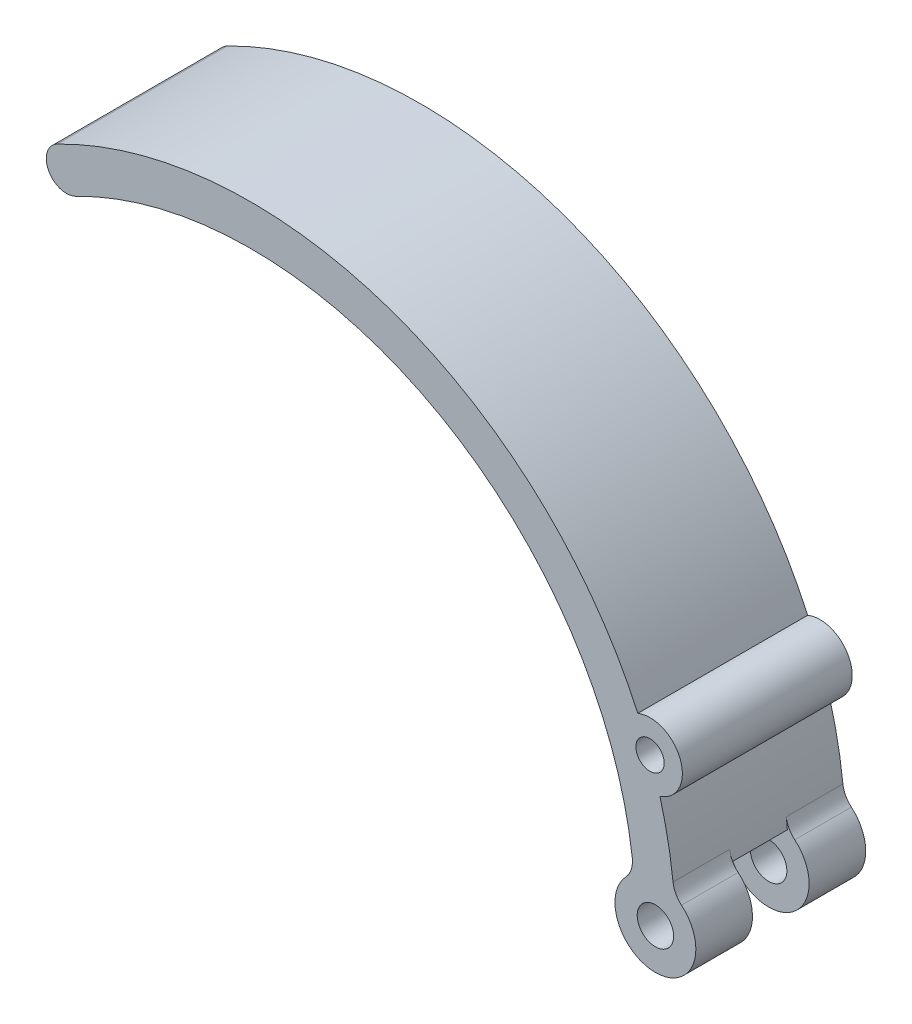
ISO-10303-21;
HEADER;
FILE_DESCRIPTION(('STEP AP214'),'2;1');
FILE_NAME('part.step','',(''),(''),'','','');
FILE_SCHEMA(('AUTOMOTIVE_DESIGN { 1 0 10303 214 1 1 1 1 }'));
ENDSEC;
DATA;
#1=APPLICATION_CONTEXT('core data for automotive mechanical design processes');
#2=APPLICATION_PROTOCOL_DEFINITION('international standard','automotive_design',2000,#1);
#3=PRODUCT_CONTEXT('',#1,'mechanical');
#4=PRODUCT('Part','Part','',(#3));
#5=PRODUCT_RELATED_PRODUCT_CATEGORY('part','',(#4));
#6=PRODUCT_DEFINITION_FORMATION('','',#4);
#7=PRODUCT_DEFINITION_CONTEXT('part definition',#1,'design');
#8=PRODUCT_DEFINITION('design','',#6,#7);
#9=PRODUCT_DEFINITION_SHAPE('','',#8);
#10=(LENGTH_UNIT() NAMED_UNIT(*) SI_UNIT(.MILLI.,.METRE.));
#11=(NAMED_UNIT(*) PLANE_ANGLE_UNIT() SI_UNIT($,.RADIAN.));
#12=(NAMED_UNIT(*) SI_UNIT($,.STERADIAN.) SOLID_ANGLE_UNIT());
#13=UNCERTAINTY_MEASURE_WITH_UNIT(LENGTH_MEASURE(1.E-05),#10,'distance_accuracy_value','');
#14=(GEOMETRIC_REPRESENTATION_CONTEXT(3) GLOBAL_UNCERTAINTY_ASSIGNED_CONTEXT((#13)) GLOBAL_UNIT_ASSIGNED_CONTEXT((#10,
#11,#12)) REPRESENTATION_CONTEXT('',''));
#15=CARTESIAN_POINT('',(0.,0.,0.));
#16=DIRECTION('',(0.,0.,1.));
#17=DIRECTION('',(1.,0.,0.));
#18=AXIS2_PLACEMENT_3D('',#15,#16,#17);
#19=CARTESIAN_POINT('',(0.,0.,21.));
#20=DIRECTION('',(0.,0.,-1.));
#21=DIRECTION('',(-1.,0.,0.));
#22=AXIS2_PLACEMENT_3D('',#19,#20,#21);
#23=CYLINDRICAL_SURFACE('',#22,52.5);
#24=CARTESIAN_POINT('',(0.,0.,0.));
#25=DIRECTION('',(0.,0.,1.));
#26=DIRECTION('',(1.,0.,0.));
#27=AXIS2_PLACEMENT_3D('',#24,#25,#26);
#28=CIRCLE('',#27,52.5);
#29=CARTESIAN_POINT('',(52.1807432432433,5.781006364183,0.));
#30=VERTEX_POINT('',#29);
#31=CARTESIAN_POINT('',(50.5577588361061,14.1478981290557,0.));
#32=VERTEX_POINT('',#31);
#33=EDGE_CURVE('E149',#30,#32,#28,.T.);
#34=ORIENTED_EDGE('',*,*,#33,.T.);
#35=DIRECTION('',(0.,0.,1.));
#36=VECTOR('',#35,1.);
#37=CARTESIAN_POINT('',(50.5577588361061,14.1478981290556,0.));
#38=LINE('',#37,#36);
#39=CARTESIAN_POINT('',(50.5577588361061,14.1478981290557,21.));
#40=VERTEX_POINT('',#39);
#41=EDGE_CURVE('E56',#32,#40,#38,.T.);
#42=ORIENTED_EDGE('',*,*,#41,.T.);
#43=CARTESIAN_POINT('',(0.,0.,21.));
#44=DIRECTION('',(0.,0.,1.));
#45=DIRECTION('',(1.,0.,0.));
#46=AXIS2_PLACEMENT_3D('',#43,#44,#45);
#47=CIRCLE('',#46,52.5);
#48=CARTESIAN_POINT('',(52.1807432432433,5.781006364183,21.));
#49=VERTEX_POINT('',#48);
#50=EDGE_CURVE('E194',#49,#40,#47,.T.);
#51=ORIENTED_EDGE('',*,*,#50,.F.);
#52=DIRECTION('',(0.,0.,-1.));
#53=VECTOR('',#52,1.);
#54=CARTESIAN_POINT('',(52.1807432432432,5.781006364183,21.));
#55=LINE('',#54,#53);
#56=CARTESIAN_POINT('',(52.1807432432433,5.781006364183,14.));
#57=VERTEX_POINT('',#56);
#58=EDGE_CURVE('E208',#49,#57,#55,.T.);
#59=ORIENTED_EDGE('',*,*,#58,.T.);
#60=CARTESIAN_POINT('',(0.,0.,14.));
#61=DIRECTION('',(0.,0.,1.));
#62=DIRECTION('',(1.,0.,0.));
#63=AXIS2_PLACEMENT_3D('',#60,#61,#62);
#64=CIRCLE('',#63,52.5);
#65=CARTESIAN_POINT('',(52.3125,4.43309640657633,14.));
#66=VERTEX_POINT('',#65);
#67=EDGE_CURVE('E198',#57,#66,#64,.F.);
#68=ORIENTED_EDGE('',*,*,#67,.T.);
#69=DIRECTION('',(0.,0.,1.));
#70=VECTOR('',#69,1.);
#71=CARTESIAN_POINT('',(52.3125,4.43309640657633,10.5));
#72=LINE('',#71,#70);
#73=CARTESIAN_POINT('',(52.3125,4.43309640657633,7.));
#74=VERTEX_POINT('',#73);
#75=EDGE_CURVE('E150',#66,#74,#72,.F.);
#76=ORIENTED_EDGE('',*,*,#75,.T.);
#77=CARTESIAN_POINT('',(0.,0.,7.));
#78=DIRECTION('',(0.,0.,1.));
#79=DIRECTION('',(1.,0.,0.));
#80=AXIS2_PLACEMENT_3D('',#77,#78,#79);
#81=CIRCLE('',#80,52.5);
#82=CARTESIAN_POINT('',(52.1807432432433,5.781006364183,7.));
#83=VERTEX_POINT('',#82);
#84=EDGE_CURVE('E211',#74,#83,#81,.T.);
#85=ORIENTED_EDGE('',*,*,#84,.T.);
#86=DIRECTION('',(0.,0.,-1.));
#87=VECTOR('',#86,1.);
#88=CARTESIAN_POINT('',(52.1807432432432,5.781006364183,21.));
#89=LINE('',#88,#87);
#90=EDGE_CURVE('E214',#83,#30,#89,.T.);
#91=ORIENTED_EDGE('',*,*,#90,.T.);
#92=EDGE_LOOP('',(#34,#42,#51,#59,#68,#76,#85,#91));
#93=FACE_BOUND('',#92,.T.);
#94=ADVANCED_FACE('F32',(#93),#23,.T.);
#95=CARTESIAN_POINT('',(50.,0.,0.));
#96=DIRECTION('',(0.,0.,1.));
#97=DIRECTION('',(1.,0.,0.));
#98=AXIS2_PLACEMENT_3D('',#95,#96,#97);
#99=CYLINDRICAL_SURFACE('',#98,5.);
#100=CARTESIAN_POINT('',(50.,0.,0.));
#101=DIRECTION('',(0.,0.,1.));
#102=DIRECTION('',(1.,0.,0.));
#103=AXIS2_PLACEMENT_3D('',#100,#101,#102);
#104=CIRCLE('',#103,5.);
#105=CARTESIAN_POINT('',(46.3515625,3.41890388993222,0.));
#106=VERTEX_POINT('',#105);
#107=CARTESIAN_POINT('',(53.2265625,3.81959349062091,0.));
#108=VERTEX_POINT('',#107);
#109=EDGE_CURVE('E184',#106,#108,#104,.T.);
#110=ORIENTED_EDGE('',*,*,#109,.T.);
#111=DIRECTION('',(0.,0.,1.));
#112=VECTOR('',#111,1.);
#113=CARTESIAN_POINT('',(53.2265625,3.81959349062091,0.));
#114=LINE('',#113,#112);
#115=CARTESIAN_POINT('',(53.2265625,3.81959349062091,7.));
#116=VERTEX_POINT('',#115);
#117=EDGE_CURVE('E220',#108,#116,#114,.T.);
#118=ORIENTED_EDGE('',*,*,#117,.T.);
#119=CARTESIAN_POINT('',(50.,0.,7.));
#120=DIRECTION('',(0.,0.,1.));
#121=DIRECTION('',(1.,0.,0.));
#122=AXIS2_PLACEMENT_3D('',#119,#120,#121);
#123=CIRCLE('',#122,5.);
#124=CARTESIAN_POINT('',(46.3515625,3.41890388993222,7.));
#125=VERTEX_POINT('',#124);
#126=EDGE_CURVE('E171',#125,#116,#123,.T.);
#127=ORIENTED_EDGE('',*,*,#126,.F.);
#128=DIRECTION('',(0.,0.,1.));
#129=VECTOR('',#128,1.);
#130=CARTESIAN_POINT('',(46.3515625,3.41890388993223,0.));
#131=LINE('',#130,#129);
#132=EDGE_CURVE('E217',#125,#106,#131,.F.);
#133=ORIENTED_EDGE('',*,*,#132,.T.);
#134=EDGE_LOOP('',(#110,#118,#127,#133));
#135=FACE_BOUND('',#134,.T.);
#136=ADVANCED_FACE('F304',(#135),#99,.T.);
#137=CARTESIAN_POINT('',(50.,0.,0.));
#138=DIRECTION('',(0.,0.,1.));
#139=DIRECTION('',(1.,0.,0.));
#140=AXIS2_PLACEMENT_3D('',#137,#138,#139);
#141=CYLINDRICAL_SURFACE('',#140,2.25);
#142=CARTESIAN_POINT('',(50.,0.,0.));
#143=DIRECTION('',(0.,0.,1.));
#144=DIRECTION('',(1.,0.,0.));
#145=AXIS2_PLACEMENT_3D('',#142,#143,#144);
#146=CIRCLE('',#145,2.25);
#147=CARTESIAN_POINT('',(52.25,0.,0.));
#148=VERTEX_POINT('',#147);
#149=EDGE_CURVE('E176',#148,#148,#146,.T.);
#150=CARTESIAN_POINT('',(50.,0.,7.));
#151=DIRECTION('',(0.,0.,1.));
#152=DIRECTION('',(1.,0.,0.));
#153=AXIS2_PLACEMENT_3D('',#150,#151,#152);
#154=CIRCLE('',#153,2.25);
#155=CARTESIAN_POINT('',(52.25,0.,7.));
#156=VERTEX_POINT('',#155);
#157=EDGE_CURVE('E180',#156,#156,#154,.F.);
#158=CARTESIAN_POINT('',(52.25,0.,0.));
#159=CARTESIAN_POINT('',(52.25,0.,0.0729166666666669));
#160=CARTESIAN_POINT('',(52.25,0.,0.145833333333333));
#161=CARTESIAN_POINT('',(52.25,0.,0.291666666666667));
#162=CARTESIAN_POINT('',(52.25,0.,0.364583333333333));
#163=CARTESIAN_POINT('',(52.25,0.,0.510416666666667));
#164=CARTESIAN_POINT('',(52.25,0.,0.583333333333333));
#165=CARTESIAN_POINT('',(52.25,0.,0.729166666666667));
#166=CARTESIAN_POINT('',(52.25,0.,0.802083333333334));
#167=CARTESIAN_POINT('',(52.25,0.,0.947916666666667));
#168=CARTESIAN_POINT('',(52.25,0.,1.02083333333333));
#169=CARTESIAN_POINT('',(52.25,0.,1.16666666666667));
#170=CARTESIAN_POINT('',(52.25,0.,1.23958333333333));
#171=CARTESIAN_POINT('',(52.25,0.,1.38541666666667));
#172=CARTESIAN_POINT('',(52.25,0.,1.45833333333333));
#173=CARTESIAN_POINT('',(52.25,0.,1.60416666666667));
#174=CARTESIAN_POINT('',(52.25,0.,1.67708333333333));
#175=CARTESIAN_POINT('',(52.25,0.,1.82291666666667));
#176=CARTESIAN_POINT('',(52.25,0.,1.89583333333333));
#177=CARTESIAN_POINT('',(52.25,0.,2.04166666666667));
#178=CARTESIAN_POINT('',(52.25,0.,2.11458333333333));
#179=CARTESIAN_POINT('',(52.25,0.,2.26041666666667));
#180=CARTESIAN_POINT('',(52.25,0.,2.33333333333333));
#181=CARTESIAN_POINT('',(52.25,0.,2.47916666666667));
#182=CARTESIAN_POINT('',(52.25,0.,2.55208333333333));
#183=CARTESIAN_POINT('',(52.25,0.,2.69791666666667));
#184=CARTESIAN_POINT('',(52.25,0.,2.77083333333333));
#185=CARTESIAN_POINT('',(52.25,0.,2.91666666666667));
#186=CARTESIAN_POINT('',(52.25,0.,2.98958333333333));
#187=CARTESIAN_POINT('',(52.25,0.,3.13541666666667));
#188=CARTESIAN_POINT('',(52.25,0.,3.20833333333333));
#189=CARTESIAN_POINT('',(52.25,0.,3.35416666666667));
#190=CARTESIAN_POINT('',(52.25,0.,3.42708333333333));
#191=CARTESIAN_POINT('',(52.25,0.,3.57291666666667));
#192=CARTESIAN_POINT('',(52.25,0.,3.64583333333333));
#193=CARTESIAN_POINT('',(52.25,0.,3.79166666666667));
#194=CARTESIAN_POINT('',(52.25,0.,3.86458333333333));
#195=CARTESIAN_POINT('',(52.25,0.,4.01041666666667));
#196=CARTESIAN_POINT('',(52.25,0.,4.08333333333333));
#197=CARTESIAN_POINT('',(52.25,0.,4.22916666666667));
#198=CARTESIAN_POINT('',(52.25,0.,4.30208333333333));
#199=CARTESIAN_POINT('',(52.25,0.,4.44791666666667));
#200=CARTESIAN_POINT('',(52.25,0.,4.52083333333333));
#201=CARTESIAN_POINT('',(52.25,0.,4.66666666666667));
#202=CARTESIAN_POINT('',(52.25,0.,4.73958333333333));
#203=CARTESIAN_POINT('',(52.25,0.,4.88541666666667));
#204=CARTESIAN_POINT('',(52.25,0.,4.95833333333333));
#205=CARTESIAN_POINT('',(52.25,0.,5.10416666666667));
#206=CARTESIAN_POINT('',(52.25,0.,5.17708333333333));
#207=CARTESIAN_POINT('',(52.25,0.,5.32291666666667));
#208=CARTESIAN_POINT('',(52.25,0.,5.39583333333333));
#209=CARTESIAN_POINT('',(52.25,0.,5.54166666666667));
#210=CARTESIAN_POINT('',(52.25,0.,5.61458333333333));
#211=CARTESIAN_POINT('',(52.25,0.,5.76041666666667));
#212=CARTESIAN_POINT('',(52.25,0.,5.83333333333334));
#213=CARTESIAN_POINT('',(52.25,0.,5.97916666666667));
#214=CARTESIAN_POINT('',(52.25,0.,6.05208333333333));
#215=CARTESIAN_POINT('',(52.25,0.,6.19791666666667));
#216=CARTESIAN_POINT('',(52.25,0.,6.27083333333333));
#217=CARTESIAN_POINT('',(52.25,0.,6.41666666666667));
#218=CARTESIAN_POINT('',(52.25,0.,6.48958333333333));
#219=CARTESIAN_POINT('',(52.25,0.,6.63541666666667));
#220=CARTESIAN_POINT('',(52.25,0.,6.70833333333333));
#221=CARTESIAN_POINT('',(52.25,0.,6.85416666666667));
#222=CARTESIAN_POINT('',(52.25,0.,6.92708333333334));
#223=CARTESIAN_POINT('',(52.25,0.,7.));
#224=B_SPLINE_CURVE_WITH_KNOTS('',3,(#158,#159,#160,#161,#162,#163,#164,#165,#166,#167,#168,
#169,#170,#171,#172,#173,#174,#175,#176,#177,#178,#179,#180,#181,#182,#183,#184,#185,#186,#187,
#188,#189,#190,#191,#192,#193,#194,#195,#196,#197,#198,#199,#200,#201,#202,#203,#204,#205,#206,
#207,#208,#209,#210,#211,#212,#213,#214,#215,#216,#217,#218,#219,#220,#221,#222,#223),
.UNSPECIFIED.,.F.,.F.,(4,2,2,2,2,2,2,2,2,2,2,2,2,2,2,2,2,2,2,2,2,2,2,2,2,2,2,2,2,2,2,2,4),(0.,
0.21875,0.4375,0.65625,0.875,1.09375,1.3125,1.53125,1.75,1.96875,2.1875,2.40625,2.625,2.84375,
3.0625,3.28125,3.5,3.71875,3.9375,4.15625,4.375,4.59375,4.8125,5.03125,5.25,5.46875,5.6875,
5.90625,6.125,6.34375,6.5625,6.78125,7.),.UNSPECIFIED.);
#225=EDGE_CURVE('BSEAM331',#148,#156,#224,.T.);
#226=ORIENTED_EDGE('',*,*,#149,.F.);
#227=ORIENTED_EDGE('',*,*,#157,.F.);
#228=ORIENTED_EDGE('',*,*,#225,.T.);
#229=ORIENTED_EDGE('',*,*,#225,.F.);
#230=EDGE_LOOP('',(#226,#228,#227,#229));
#231=FACE_BOUND('',#230,.T.);
#232=ADVANCED_FACE('F331',(#231),#141,.F.);
#233=CARTESIAN_POINT('',(47.8235838334131,21.6599822097921,21.));
#234=VERTEX_POINT('',#233);
#235=CARTESIAN_POINT('',(-23.9438502815787,46.7219652165161,21.));
#236=VERTEX_POINT('',#235);
#237=EDGE_CURVE('E48',#234,#236,#47,.T.);
#238=ORIENTED_EDGE('',*,*,#237,.F.);
#239=DIRECTION('',(0.,0.,1.));
#240=VECTOR('',#239,1.);
#241=CARTESIAN_POINT('',(47.8235838334131,21.6599822097921,0.));
#242=LINE('',#241,#240);
#243=CARTESIAN_POINT('',(47.8235838334131,21.6599822097921,0.));
#244=VERTEX_POINT('',#243);
#245=EDGE_CURVE('E152',#244,#234,#242,.T.);
#246=ORIENTED_EDGE('',*,*,#245,.F.);
#247=CARTESIAN_POINT('',(-23.9438502815787,46.7219652165161,0.));
#248=VERTEX_POINT('',#247);
#249=EDGE_CURVE('E141',#244,#248,#28,.T.);
#250=ORIENTED_EDGE('',*,*,#249,.T.);
#251=DIRECTION('',(0.,0.,-1.));
#252=VECTOR('',#251,1.);
#253=CARTESIAN_POINT('',(-23.9438502815787,46.7219652165161,21.));
#254=LINE('',#253,#252);
#255=EDGE_CURVE('E256',#248,#236,#254,.F.);
#256=ORIENTED_EDGE('',*,*,#255,.T.);
#257=EDGE_LOOP('',(#238,#246,#250,#256));
#258=FACE_BOUND('',#257,.T.);
#259=ADVANCED_FACE('F153',(#258),#23,.T.);
#260=CARTESIAN_POINT('',(0.,0.,21.));
#261=DIRECTION('',(0.,0.,-1.));
#262=DIRECTION('',(-1.,0.,0.));
#263=AXIS2_PLACEMENT_3D('',#260,#261,#262);
#264=CYLINDRICAL_SURFACE('',#263,47.5);
#265=CARTESIAN_POINT('',(0.,0.,21.));
#266=DIRECTION('',(0.,0.,1.));
#267=DIRECTION('',(1.,0.,0.));
#268=AXIS2_PLACEMENT_3D('',#265,#266,#267);
#269=CIRCLE('',#268,47.5);
#270=CARTESIAN_POINT('',(47.1397471910112,5.83902686819886,21.));
#271=VERTEX_POINT('',#270);
#272=CARTESIAN_POINT('',(-21.663483588095,42.2722542435146,21.));
#273=VERTEX_POINT('',#272);
#274=EDGE_CURVE('E196',#271,#273,#269,.T.);
#275=ORIENTED_EDGE('',*,*,#274,.T.);
#276=DIRECTION('',(0.,0.,-1.));
#277=VECTOR('',#276,1.);
#278=CARTESIAN_POINT('',(-21.663483588095,42.2722542435146,21.));
#279=LINE('',#278,#277);
#280=CARTESIAN_POINT('',(-21.663483588095,42.2722542435146,0.));
#281=VERTEX_POINT('',#280);
#282=EDGE_CURVE('E11',#273,#281,#279,.T.);
#283=ORIENTED_EDGE('',*,*,#282,.T.);
#284=CARTESIAN_POINT('',(0.,0.,0.));
#285=DIRECTION('',(0.,0.,1.));
#286=DIRECTION('',(1.,0.,0.));
#287=AXIS2_PLACEMENT_3D('',#284,#285,#286);
#288=CIRCLE('',#287,47.5);
#289=CARTESIAN_POINT('',(47.1397471910112,5.83902686819886,0.));
#290=VERTEX_POINT('',#289);
#291=EDGE_CURVE('E200',#290,#281,#288,.T.);
#292=ORIENTED_EDGE('',*,*,#291,.F.);
#293=DIRECTION('',(0.,0.,-1.));
#294=VECTOR('',#293,1.);
#295=CARTESIAN_POINT('',(47.1397471910112,5.83902686819886,21.));
#296=LINE('',#295,#294);
#297=CARTESIAN_POINT('',(47.1397471910112,5.83902686819886,7.));
#298=VERTEX_POINT('',#297);
#299=EDGE_CURVE('E229',#290,#298,#296,.F.);
#300=ORIENTED_EDGE('',*,*,#299,.T.);
#301=CARTESIAN_POINT('',(0.,0.,7.));
#302=DIRECTION('',(0.,0.,1.));
#303=DIRECTION('',(1.,0.,0.));
#304=AXIS2_PLACEMENT_3D('',#301,#302,#303);
#305=CIRCLE('',#304,47.5);
#306=CARTESIAN_POINT('',(47.3125,4.21631874388072,7.));
#307=VERTEX_POINT('',#306);
#308=EDGE_CURVE('E227',#298,#307,#305,.F.);
#309=ORIENTED_EDGE('',*,*,#308,.T.);
#310=DIRECTION('',(0.,0.,1.));
#311=VECTOR('',#310,1.);
#312=CARTESIAN_POINT('',(47.3125,4.21631874388073,10.5));
#313=LINE('',#312,#311);
#314=CARTESIAN_POINT('',(47.3125,4.21631874388072,14.));
#315=VERTEX_POINT('',#314);
#316=EDGE_CURVE('E187',#315,#307,#313,.F.);
#317=ORIENTED_EDGE('',*,*,#316,.F.);
#318=CARTESIAN_POINT('',(0.,0.,14.));
#319=DIRECTION('',(0.,0.,1.));
#320=DIRECTION('',(1.,0.,0.));
#321=AXIS2_PLACEMENT_3D('',#318,#319,#320);
#322=CIRCLE('',#321,47.5);
#323=CARTESIAN_POINT('',(47.1397471910112,5.83902686819886,14.));
#324=VERTEX_POINT('',#323);
#325=EDGE_CURVE('E234',#315,#324,#322,.T.);
#326=ORIENTED_EDGE('',*,*,#325,.T.);
#327=DIRECTION('',(0.,0.,-1.));
#328=VECTOR('',#327,1.);
#329=CARTESIAN_POINT('',(47.1397471910112,5.83902686819886,21.));
#330=LINE('',#329,#328);
#331=EDGE_CURVE('E232',#324,#271,#330,.F.);
#332=ORIENTED_EDGE('',*,*,#331,.T.);
#333=EDGE_LOOP('',(#275,#283,#292,#300,#309,#317,#326,#332));
#334=FACE_BOUND('',#333,.T.);
#335=ADVANCED_FACE('F313',(#334),#264,.F.);
#336=CARTESIAN_POINT('',(0.,0.,21.));
#337=DIRECTION('',(0.,0.,1.));
#338=DIRECTION('',(1.,0.,0.));
#339=AXIS2_PLACEMENT_3D('',#336,#337,#338);
#340=PLANE('',#339);
#341=CARTESIAN_POINT('',(49.3338625912603,17.9560575245973,21.));
#342=DIRECTION('',(0.,0.,1.));
#343=DIRECTION('',(1.,0.,0.));
#344=AXIS2_PLACEMENT_3D('',#341,#342,#343);
#345=CIRCLE('',#344,1.75);
#346=CARTESIAN_POINT('',(51.0838625912603,17.9560575245973,21.));
#347=VERTEX_POINT('',#346);
#348=EDGE_CURVE('E162',#347,#347,#345,.T.);
#349=ORIENTED_EDGE('',*,*,#348,.F.);
#350=EDGE_LOOP('',(#349));
#351=FACE_BOUND('',#350,.T.);
#352=CARTESIAN_POINT('',(50.,0.,21.));
#353=DIRECTION('',(0.,0.,1.));
#354=DIRECTION('',(1.,0.,0.));
#355=AXIS2_PLACEMENT_3D('',#352,#353,#354);
#356=CIRCLE('',#355,2.25);
#357=CARTESIAN_POINT('',(52.25,0.,21.));
#358=VERTEX_POINT('',#357);
#359=EDGE_CURVE('E179',#358,#358,#356,.T.);
#360=ORIENTED_EDGE('',*,*,#359,.F.);
#361=EDGE_LOOP('',(#360));
#362=FACE_BOUND('',#361,.T.);
#363=ORIENTED_EDGE('',*,*,#50,.T.);
#364=CARTESIAN_POINT('',(49.3338625912603,17.9560575245973,21.));
#365=DIRECTION('',(0.,0.,1.));
#366=DIRECTION('',(-1.,0.,0.));
#367=AXIS2_PLACEMENT_3D('',#364,#365,#366);
#368=CIRCLE('',#367,4.00000000000001);
#369=EDGE_CURVE('E159',#40,#234,#368,.T.);
#370=ORIENTED_EDGE('',*,*,#369,.T.);
#371=ORIENTED_EDGE('',*,*,#237,.T.);
#372=CARTESIAN_POINT('',(-22.8036669348369,44.4971097300154,21.));
#373=DIRECTION('',(0.,0.,1.));
#374=DIRECTION('',(1.,0.,0.));
#375=AXIS2_PLACEMENT_3D('',#372,#373,#374);
#376=CIRCLE('',#375,2.5);
#377=CARTESIAN_POINT('',(-24.9687304442979,43.2471097300154,21.));
#378=VERTEX_POINT('',#377);
#379=EDGE_CURVE('E41',#236,#378,#376,.T.);
#380=ORIENTED_EDGE('',*,*,#379,.T.);
#381=CARTESIAN_POINT('',(-22.8036669348369,44.4971097300154,21.));
#382=DIRECTION('',(0.,0.,1.));
#383=DIRECTION('',(1.,0.,0.));
#384=AXIS2_PLACEMENT_3D('',#381,#382,#383);
#385=CIRCLE('',#384,2.5);
#386=EDGE_CURVE('E258',#378,#273,#385,.T.);
#387=ORIENTED_EDGE('',*,*,#386,.T.);
#388=ORIENTED_EDGE('',*,*,#274,.F.);
#389=CARTESIAN_POINT('',(44.1625,5.47024622389156,21.));
#390=DIRECTION('',(0.,0.,1.));
#391=DIRECTION('',(1.,0.,0.));
#392=AXIS2_PLACEMENT_3D('',#389,#390,#391);
#393=CIRCLE('',#392,3.);
#394=CARTESIAN_POINT('',(46.3515625,3.41890388993222,21.));
#395=VERTEX_POINT('',#394);
#396=EDGE_CURVE('E247',#271,#395,#393,.F.);
#397=ORIENTED_EDGE('',*,*,#396,.T.);
#398=CARTESIAN_POINT('',(50.,0.,21.));
#399=DIRECTION('',(0.,0.,1.));
#400=DIRECTION('',(1.,0.,0.));
#401=AXIS2_PLACEMENT_3D('',#398,#399,#400);
#402=CIRCLE('',#401,5.);
#403=CARTESIAN_POINT('',(53.2265625,3.81959349062091,21.));
#404=VERTEX_POINT('',#403);
#405=EDGE_CURVE('E183',#395,#404,#402,.T.);
#406=ORIENTED_EDGE('',*,*,#405,.T.);
#407=CARTESIAN_POINT('',(55.1625,6.11134958499345,21.));
#408=DIRECTION('',(0.,0.,1.));
#409=DIRECTION('',(1.,0.,0.));
#410=AXIS2_PLACEMENT_3D('',#407,#408,#409);
#411=CIRCLE('',#410,3.);
#412=EDGE_CURVE('E243',#404,#49,#411,.F.);
#413=ORIENTED_EDGE('',*,*,#412,.T.);
#414=EDGE_LOOP('',(#363,#370,#371,#380,#387,#388,#397,#406,#413));
#415=FACE_BOUND('',#414,.T.);
#416=ADVANCED_FACE('F263',(#351,#362,#415),#340,.T.);
#417=CARTESIAN_POINT('',(0.,0.,0.));
#418=DIRECTION('',(0.,0.,1.));
#419=DIRECTION('',(1.,0.,0.));
#420=AXIS2_PLACEMENT_3D('',#417,#418,#419);
#421=PLANE('',#420);
#422=CARTESIAN_POINT('',(49.3338625912603,17.9560575245973,0.));
#423=DIRECTION('',(0.,0.,1.));
#424=DIRECTION('',(1.,0.,0.));
#425=AXIS2_PLACEMENT_3D('',#422,#423,#424);
#426=CIRCLE('',#425,1.75);
#427=CARTESIAN_POINT('',(51.0838625912603,17.9560575245973,0.));
#428=VERTEX_POINT('',#427);
#429=EDGE_CURVE('E369',#428,#428,#426,.T.);
#430=ORIENTED_EDGE('',*,*,#429,.T.);
#431=EDGE_LOOP('',(#430));
#432=FACE_BOUND('',#431,.T.);
#433=ORIENTED_EDGE('',*,*,#149,.T.);
#434=EDGE_LOOP('',(#433));
#435=FACE_BOUND('',#434,.T.);
#436=CARTESIAN_POINT('',(-22.8036669348369,44.4971097300154,0.));
#437=DIRECTION('',(0.,0.,1.));
#438=DIRECTION('',(1.,0.,0.));
#439=AXIS2_PLACEMENT_3D('',#436,#437,#438);
#440=CIRCLE('',#439,2.5);
#441=CARTESIAN_POINT('',(-24.9687304442979,43.2471097300154,0.));
#442=VERTEX_POINT('',#441);
#443=EDGE_CURVE('E253',#281,#442,#440,.F.);
#444=ORIENTED_EDGE('',*,*,#443,.T.);
#445=CARTESIAN_POINT('',(-22.8036669348369,44.4971097300154,0.));
#446=DIRECTION('',(0.,0.,1.));
#447=DIRECTION('',(1.,0.,0.));
#448=AXIS2_PLACEMENT_3D('',#445,#446,#447);
#449=CIRCLE('',#448,2.5);
#450=EDGE_CURVE('E147',#442,#248,#449,.F.);
#451=ORIENTED_EDGE('',*,*,#450,.T.);
#452=ORIENTED_EDGE('',*,*,#249,.F.);
#453=CARTESIAN_POINT('',(49.3338625912603,17.9560575245973,0.));
#454=DIRECTION('',(0.,0.,1.));
#455=DIRECTION('',(-1.,0.,0.));
#456=AXIS2_PLACEMENT_3D('',#453,#454,#455);
#457=CIRCLE('',#456,4.00000000000001);
#458=EDGE_CURVE('E145',#32,#244,#457,.T.);
#459=ORIENTED_EDGE('',*,*,#458,.F.);
#460=ORIENTED_EDGE('',*,*,#33,.F.);
#461=CARTESIAN_POINT('',(55.1625,6.11134958499345,0.));
#462=DIRECTION('',(0.,0.,1.));
#463=DIRECTION('',(1.,0.,0.));
#464=AXIS2_PLACEMENT_3D('',#461,#462,#463);
#465=CIRCLE('',#464,3.);
#466=EDGE_CURVE('E237',#30,#108,#465,.T.);
#467=ORIENTED_EDGE('',*,*,#466,.T.);
#468=ORIENTED_EDGE('',*,*,#109,.F.);
#469=CARTESIAN_POINT('',(44.1625,5.47024622389156,0.));
#470=DIRECTION('',(0.,0.,1.));
#471=DIRECTION('',(1.,0.,0.));
#472=AXIS2_PLACEMENT_3D('',#469,#470,#471);
#473=CIRCLE('',#472,3.);
#474=EDGE_CURVE('E249',#106,#290,#473,.T.);
#475=ORIENTED_EDGE('',*,*,#474,.T.);
#476=ORIENTED_EDGE('',*,*,#291,.T.);
#477=EDGE_LOOP('',(#444,#451,#452,#459,#460,#467,#468,#475,#476));
#478=FACE_BOUND('',#477,.T.);
#479=ADVANCED_FACE('F142',(#432,#435,#478),#421,.F.);
#480=CARTESIAN_POINT('',(50.,0.,14.));
#481=DIRECTION('',(0.,0.,1.));
#482=DIRECTION('',(1.,0.,0.));
#483=AXIS2_PLACEMENT_3D('',#480,#481,#482);
#484=CIRCLE('',#483,5.);
#485=CARTESIAN_POINT('',(46.3515625,3.41890388993222,14.));
#486=VERTEX_POINT('',#485);
#487=CARTESIAN_POINT('',(53.2265625,3.81959349062091,14.));
#488=VERTEX_POINT('',#487);
#489=EDGE_CURVE('E175',#486,#488,#484,.T.);
#490=ORIENTED_EDGE('',*,*,#489,.T.);
#491=DIRECTION('',(0.,0.,1.));
#492=VECTOR('',#491,1.);
#493=CARTESIAN_POINT('',(53.2265625,3.81959349062091,0.));
#494=LINE('',#493,#492);
#495=EDGE_CURVE('E225',#488,#404,#494,.T.);
#496=ORIENTED_EDGE('',*,*,#495,.T.);
#497=ORIENTED_EDGE('',*,*,#405,.F.);
#498=DIRECTION('',(0.,0.,1.));
#499=VECTOR('',#498,1.);
#500=CARTESIAN_POINT('',(46.3515625,3.41890388993223,0.));
#501=LINE('',#500,#499);
#502=EDGE_CURVE('E222',#395,#486,#501,.F.);
#503=ORIENTED_EDGE('',*,*,#502,.T.);
#504=EDGE_LOOP('',(#490,#496,#497,#503));
#505=FACE_BOUND('',#504,.T.);
#506=ADVANCED_FACE('F276',(#505),#99,.T.);
#507=CARTESIAN_POINT('',(50.,0.,14.));
#508=DIRECTION('',(0.,0.,1.));
#509=DIRECTION('',(1.,0.,0.));
#510=AXIS2_PLACEMENT_3D('',#507,#508,#509);
#511=CIRCLE('',#510,2.25);
#512=CARTESIAN_POINT('',(52.25,0.,14.));
#513=VERTEX_POINT('',#512);
#514=EDGE_CURVE('E170',#513,#513,#511,.F.);
#515=CARTESIAN_POINT('',(52.25,0.,14.));
#516=CARTESIAN_POINT('',(52.25,0.,14.0729166666667));
#517=CARTESIAN_POINT('',(52.25,0.,14.1458333333333));
#518=CARTESIAN_POINT('',(52.25,0.,14.2916666666667));
#519=CARTESIAN_POINT('',(52.25,0.,14.3645833333333));
#520=CARTESIAN_POINT('',(52.25,0.,14.5104166666667));
#521=CARTESIAN_POINT('',(52.25,0.,14.5833333333333));
#522=CARTESIAN_POINT('',(52.25,0.,14.7291666666667));
#523=CARTESIAN_POINT('',(52.25,0.,14.8020833333333));
#524=CARTESIAN_POINT('',(52.25,0.,14.9479166666667));
#525=CARTESIAN_POINT('',(52.25,0.,15.0208333333333));
#526=CARTESIAN_POINT('',(52.25,0.,15.1666666666667));
#527=CARTESIAN_POINT('',(52.25,0.,15.2395833333333));
#528=CARTESIAN_POINT('',(52.25,0.,15.3854166666667));
#529=CARTESIAN_POINT('',(52.25,0.,15.4583333333333));
#530=CARTESIAN_POINT('',(52.25,0.,15.6041666666667));
#531=CARTESIAN_POINT('',(52.25,0.,15.6770833333333));
#532=CARTESIAN_POINT('',(52.25,0.,15.8229166666667));
#533=CARTESIAN_POINT('',(52.25,0.,15.8958333333333));
#534=CARTESIAN_POINT('',(52.25,0.,16.0416666666667));
#535=CARTESIAN_POINT('',(52.25,0.,16.1145833333333));
#536=CARTESIAN_POINT('',(52.25,0.,16.2604166666667));
#537=CARTESIAN_POINT('',(52.25,0.,16.3333333333333));
#538=CARTESIAN_POINT('',(52.25,0.,16.4791666666667));
#539=CARTESIAN_POINT('',(52.25,0.,16.5520833333333));
#540=CARTESIAN_POINT('',(52.25,0.,16.6979166666667));
#541=CARTESIAN_POINT('',(52.25,0.,16.7708333333333));
#542=CARTESIAN_POINT('',(52.25,0.,16.9166666666667));
#543=CARTESIAN_POINT('',(52.25,0.,16.9895833333333));
#544=CARTESIAN_POINT('',(52.25,0.,17.1354166666667));
#545=CARTESIAN_POINT('',(52.25,0.,17.2083333333333));
#546=CARTESIAN_POINT('',(52.25,0.,17.3541666666667));
#547=CARTESIAN_POINT('',(52.25,0.,17.4270833333333));
#548=CARTESIAN_POINT('',(52.25,0.,17.5729166666667));
#549=CARTESIAN_POINT('',(52.25,0.,17.6458333333333));
#550=CARTESIAN_POINT('',(52.25,0.,17.7916666666667));
#551=CARTESIAN_POINT('',(52.25,0.,17.8645833333333));
#552=CARTESIAN_POINT('',(52.25,0.,18.0104166666667));
#553=CARTESIAN_POINT('',(52.25,0.,18.0833333333333));
#554=CARTESIAN_POINT('',(52.25,0.,18.2291666666667));
#555=CARTESIAN_POINT('',(52.25,0.,18.3020833333333));
#556=CARTESIAN_POINT('',(52.25,0.,18.4479166666667));
#557=CARTESIAN_POINT('',(52.25,0.,18.5208333333333));
#558=CARTESIAN_POINT('',(52.25,0.,18.6666666666667));
#559=CARTESIAN_POINT('',(52.25,0.,18.7395833333333));
#560=CARTESIAN_POINT('',(52.25,0.,18.8854166666667));
#561=CARTESIAN_POINT('',(52.25,0.,18.9583333333333));
#562=CARTESIAN_POINT('',(52.25,0.,19.1041666666667));
#563=CARTESIAN_POINT('',(52.25,0.,19.1770833333333));
#564=CARTESIAN_POINT('',(52.25,0.,19.3229166666667));
#565=CARTESIAN_POINT('',(52.25,0.,19.3958333333333));
#566=CARTESIAN_POINT('',(52.25,0.,19.5416666666667));
#567=CARTESIAN_POINT('',(52.25,0.,19.6145833333333));
#568=CARTESIAN_POINT('',(52.25,0.,19.7604166666667));
#569=CARTESIAN_POINT('',(52.25,0.,19.8333333333333));
#570=CARTESIAN_POINT('',(52.25,0.,19.9791666666667));
#571=CARTESIAN_POINT('',(52.25,0.,20.0520833333333));
#572=CARTESIAN_POINT('',(52.25,0.,20.1979166666667));
#573=CARTESIAN_POINT('',(52.25,0.,20.2708333333333));
#574=CARTESIAN_POINT('',(52.25,0.,20.4166666666667));
#575=CARTESIAN_POINT('',(52.25,0.,20.4895833333333));
#576=CARTESIAN_POINT('',(52.25,0.,20.6354166666667));
#577=CARTESIAN_POINT('',(52.25,0.,20.7083333333333));
#578=CARTESIAN_POINT('',(52.25,0.,20.8541666666667));
#579=CARTESIAN_POINT('',(52.25,0.,20.9270833333333));
#580=CARTESIAN_POINT('',(52.25,0.,21.));
#581=B_SPLINE_CURVE_WITH_KNOTS('',3,(#515,#516,#517,#518,#519,#520,#521,#522,#523,#524,#525,
#526,#527,#528,#529,#530,#531,#532,#533,#534,#535,#536,#537,#538,#539,#540,#541,#542,#543,#544,
#545,#546,#547,#548,#549,#550,#551,#552,#553,#554,#555,#556,#557,#558,#559,#560,#561,#562,#563,
#564,#565,#566,#567,#568,#569,#570,#571,#572,#573,#574,#575,#576,#577,#578,#579,#580),
.UNSPECIFIED.,.F.,.F.,(4,2,2,2,2,2,2,2,2,2,2,2,2,2,2,2,2,2,2,2,2,2,2,2,2,2,2,2,2,2,2,2,4),(0.,
0.21875,0.4375,0.656250000000001,0.875000000000001,1.09375,1.3125,1.53125,1.75,1.96875,2.1875,
2.40625,2.625,2.84375,3.0625,3.28125,3.5,3.71875,3.9375,4.15625,4.375,4.59375,4.8125,5.03125,
5.25,5.46875,5.6875,5.90625,6.125,6.34375,6.5625,6.78125,7.),.UNSPECIFIED.);
#582=EDGE_CURVE('BSEAM342',#513,#358,#581,.T.);
#583=ORIENTED_EDGE('',*,*,#514,.T.);
#584=ORIENTED_EDGE('',*,*,#359,.T.);
#585=ORIENTED_EDGE('',*,*,#582,.T.);
#586=ORIENTED_EDGE('',*,*,#582,.F.);
#587=EDGE_LOOP('',(#583,#585,#584,#586));
#588=FACE_BOUND('',#587,.T.);
#589=ADVANCED_FACE('F342',(#588),#141,.F.);
#590=CARTESIAN_POINT('',(50.,0.,7.));
#591=DIRECTION('',(0.,0.,1.));
#592=DIRECTION('',(1.,0.,0.));
#593=AXIS2_PLACEMENT_3D('',#590,#591,#592);
#594=CYLINDRICAL_SURFACE('',#593,5.);
#595=EDGE_CURVE('E172',#66,#315,#484,.T.);
#596=ORIENTED_EDGE('',*,*,#595,.T.);
#597=ORIENTED_EDGE('',*,*,#316,.T.);
#598=EDGE_CURVE('E167',#74,#307,#123,.T.);
#599=ORIENTED_EDGE('',*,*,#598,.F.);
#600=ORIENTED_EDGE('',*,*,#75,.F.);
#601=EDGE_LOOP('',(#596,#597,#599,#600));
#602=FACE_BOUND('',#601,.T.);
#603=ADVANCED_FACE('F292',(#602),#594,.F.);
#604=CARTESIAN_POINT('',(50.,0.,7.));
#605=DIRECTION('',(0.,0.,1.));
#606=DIRECTION('',(1.,0.,0.));
#607=AXIS2_PLACEMENT_3D('',#604,#605,#606);
#608=PLANE('',#607);
#609=ORIENTED_EDGE('',*,*,#598,.T.);
#610=ORIENTED_EDGE('',*,*,#308,.F.);
#611=CARTESIAN_POINT('',(44.1625,5.47024622389156,7.));
#612=DIRECTION('',(0.,0.,1.));
#613=DIRECTION('',(1.,0.,0.));
#614=AXIS2_PLACEMENT_3D('',#611,#612,#613);
#615=CIRCLE('',#614,3.);
#616=EDGE_CURVE('E251',#298,#125,#615,.F.);
#617=ORIENTED_EDGE('',*,*,#616,.T.);
#618=ORIENTED_EDGE('',*,*,#126,.T.);
#619=CARTESIAN_POINT('',(55.1625,6.11134958499345,7.));
#620=DIRECTION('',(0.,0.,1.));
#621=DIRECTION('',(1.,0.,0.));
#622=AXIS2_PLACEMENT_3D('',#619,#620,#621);
#623=CIRCLE('',#622,3.);
#624=EDGE_CURVE('E239',#116,#83,#623,.F.);
#625=ORIENTED_EDGE('',*,*,#624,.T.);
#626=ORIENTED_EDGE('',*,*,#84,.F.);
#627=EDGE_LOOP('',(#609,#610,#617,#618,#625,#626));
#628=FACE_BOUND('',#627,.T.);
#629=ORIENTED_EDGE('',*,*,#157,.T.);
#630=EDGE_LOOP('',(#629));
#631=FACE_BOUND('',#630,.T.);
#632=ADVANCED_FACE('F294',(#628,#631),#608,.T.);
#633=CARTESIAN_POINT('',(50.,0.,14.));
#634=DIRECTION('',(0.,0.,1.));
#635=DIRECTION('',(1.,0.,0.));
#636=AXIS2_PLACEMENT_3D('',#633,#634,#635);
#637=PLANE('',#636);
#638=ORIENTED_EDGE('',*,*,#595,.F.);
#639=ORIENTED_EDGE('',*,*,#67,.F.);
#640=CARTESIAN_POINT('',(55.1625,6.11134958499345,14.));
#641=DIRECTION('',(0.,0.,1.));
#642=DIRECTION('',(1.,0.,0.));
#643=AXIS2_PLACEMENT_3D('',#640,#641,#642);
#644=CIRCLE('',#643,3.);
#645=EDGE_CURVE('E241',#57,#488,#644,.T.);
#646=ORIENTED_EDGE('',*,*,#645,.T.);
#647=ORIENTED_EDGE('',*,*,#489,.F.);
#648=CARTESIAN_POINT('',(44.1625,5.47024622389156,14.));
#649=DIRECTION('',(0.,0.,1.));
#650=DIRECTION('',(1.,0.,0.));
#651=AXIS2_PLACEMENT_3D('',#648,#649,#650);
#652=CIRCLE('',#651,3.);
#653=EDGE_CURVE('E245',#486,#324,#652,.T.);
#654=ORIENTED_EDGE('',*,*,#653,.T.);
#655=ORIENTED_EDGE('',*,*,#325,.F.);
#656=EDGE_LOOP('',(#638,#639,#646,#647,#654,#655));
#657=FACE_BOUND('',#656,.T.);
#658=ORIENTED_EDGE('',*,*,#514,.F.);
#659=EDGE_LOOP('',(#658));
#660=FACE_BOUND('',#659,.T.);
#661=ADVANCED_FACE('F288',(#657,#660),#637,.F.);
#662=CARTESIAN_POINT('',(55.1625,6.11134958499345,0.));
#663=DIRECTION('',(0.,0.,1.));
#664=DIRECTION('',(1.,0.,0.));
#665=AXIS2_PLACEMENT_3D('',#662,#663,#664);
#666=CYLINDRICAL_SURFACE('',#665,3.);
#667=ORIENTED_EDGE('',*,*,#624,.F.);
#668=ORIENTED_EDGE('',*,*,#117,.F.);
#669=ORIENTED_EDGE('',*,*,#466,.F.);
#670=ORIENTED_EDGE('',*,*,#90,.F.);
#671=EDGE_LOOP('',(#667,#668,#669,#670));
#672=FACE_BOUND('',#671,.T.);
#673=ADVANCED_FACE('F300',(#672),#666,.F.);
#674=CARTESIAN_POINT('',(55.1625,6.11134958499345,0.));
#675=DIRECTION('',(0.,0.,1.));
#676=DIRECTION('',(1.,0.,0.));
#677=AXIS2_PLACEMENT_3D('',#674,#675,#676);
#678=CYLINDRICAL_SURFACE('',#677,3.);
#679=ORIENTED_EDGE('',*,*,#412,.F.);
#680=ORIENTED_EDGE('',*,*,#495,.F.);
#681=ORIENTED_EDGE('',*,*,#645,.F.);
#682=ORIENTED_EDGE('',*,*,#58,.F.);
#683=EDGE_LOOP('',(#679,#680,#681,#682));
#684=FACE_BOUND('',#683,.T.);
#685=ADVANCED_FACE('F282',(#684),#678,.F.);
#686=CARTESIAN_POINT('',(44.1625,5.47024622389156,21.));
#687=DIRECTION('',(0.,0.,-1.));
#688=DIRECTION('',(-1.,0.,0.));
#689=AXIS2_PLACEMENT_3D('',#686,#687,#688);
#690=CYLINDRICAL_SURFACE('',#689,3.);
#691=ORIENTED_EDGE('',*,*,#396,.F.);
#692=ORIENTED_EDGE('',*,*,#331,.F.);
#693=ORIENTED_EDGE('',*,*,#653,.F.);
#694=ORIENTED_EDGE('',*,*,#502,.F.);
#695=EDGE_LOOP('',(#691,#692,#693,#694));
#696=FACE_BOUND('',#695,.T.);
#697=ADVANCED_FACE('F317',(#696),#690,.F.);
#698=CARTESIAN_POINT('',(44.1625,5.47024622389156,21.));
#699=DIRECTION('',(0.,0.,-1.));
#700=DIRECTION('',(-1.,0.,0.));
#701=AXIS2_PLACEMENT_3D('',#698,#699,#700);
#702=CYLINDRICAL_SURFACE('',#701,3.);
#703=ORIENTED_EDGE('',*,*,#616,.F.);
#704=ORIENTED_EDGE('',*,*,#299,.F.);
#705=ORIENTED_EDGE('',*,*,#474,.F.);
#706=ORIENTED_EDGE('',*,*,#132,.F.);
#707=EDGE_LOOP('',(#703,#704,#705,#706));
#708=FACE_BOUND('',#707,.T.);
#709=ADVANCED_FACE('F309',(#708),#702,.F.);
#710=CARTESIAN_POINT('',(-22.8036669348369,44.4971097300154,21.));
#711=DIRECTION('',(0.,0.,-1.));
#712=DIRECTION('',(-1.,0.,0.));
#713=AXIS2_PLACEMENT_3D('',#710,#711,#712);
#714=CYLINDRICAL_SURFACE('',#713,2.5);
#715=ORIENTED_EDGE('',*,*,#282,.F.);
#716=ORIENTED_EDGE('',*,*,#386,.F.);
#717=DIRECTION('',(0.,0.,-1.));
#718=VECTOR('',#717,1.);
#719=CARTESIAN_POINT('',(-24.9687304442979,43.2471097300154,21.));
#720=LINE('',#719,#718);
#721=EDGE_CURVE('E36',#442,#378,#720,.F.);
#722=ORIENTED_EDGE('',*,*,#721,.F.);
#723=ORIENTED_EDGE('',*,*,#443,.F.);
#724=EDGE_LOOP('',(#715,#716,#722,#723));
#725=FACE_BOUND('',#724,.T.);
#726=ADVANCED_FACE('F34',(#725),#714,.T.);
#727=CARTESIAN_POINT('',(-22.8036669348369,44.4971097300154,21.));
#728=DIRECTION('',(0.,0.,-1.));
#729=DIRECTION('',(-1.,0.,0.));
#730=AXIS2_PLACEMENT_3D('',#727,#728,#729);
#731=CYLINDRICAL_SURFACE('',#730,2.5);
#732=ORIENTED_EDGE('',*,*,#379,.F.);
#733=ORIENTED_EDGE('',*,*,#255,.F.);
#734=ORIENTED_EDGE('',*,*,#450,.F.);
#735=ORIENTED_EDGE('',*,*,#721,.T.);
#736=EDGE_LOOP('',(#732,#733,#734,#735));
#737=FACE_BOUND('',#736,.T.);
#738=ADVANCED_FACE('F271',(#737),#731,.T.);
#739=CARTESIAN_POINT('',(49.3338625912603,17.9560575245973,0.));
#740=DIRECTION('',(0.,0.,1.));
#741=DIRECTION('',(1.,0.,0.));
#742=AXIS2_PLACEMENT_3D('',#739,#740,#741);
#743=CYLINDRICAL_SURFACE('',#742,4.00000000000001);
#744=ORIENTED_EDGE('',*,*,#369,.F.);
#745=ORIENTED_EDGE('',*,*,#41,.F.);
#746=ORIENTED_EDGE('',*,*,#458,.T.);
#747=ORIENTED_EDGE('',*,*,#245,.T.);
#748=EDGE_LOOP('',(#744,#745,#746,#747));
#749=FACE_BOUND('',#748,.T.);
#750=ADVANCED_FACE('F158',(#749),#743,.T.);
#751=CARTESIAN_POINT('',(49.3338625912603,17.9560575245973,0.));
#752=DIRECTION('',(0.,0.,1.));
#753=DIRECTION('',(1.,0.,0.));
#754=AXIS2_PLACEMENT_3D('',#751,#752,#753);
#755=CYLINDRICAL_SURFACE('',#754,1.75);
#756=CARTESIAN_POINT('',(51.0838625912603,17.9560575245973,21.));
#757=CARTESIAN_POINT('',(51.0838625912603,17.9560575245973,20.78125));
#758=CARTESIAN_POINT('',(51.0838625912603,17.9560575245973,20.5625));
#759=CARTESIAN_POINT('',(51.0838625912603,17.9560575245973,20.125));
#760=CARTESIAN_POINT('',(51.0838625912603,17.9560575245973,19.90625));
#761=CARTESIAN_POINT('',(51.0838625912603,17.9560575245973,19.46875));
#762=CARTESIAN_POINT('',(51.0838625912603,17.9560575245973,19.25));
#763=CARTESIAN_POINT('',(51.0838625912603,17.9560575245973,18.8125));
#764=CARTESIAN_POINT('',(51.0838625912603,17.9560575245973,18.59375));
#765=CARTESIAN_POINT('',(51.0838625912603,17.9560575245973,18.15625));
#766=CARTESIAN_POINT('',(51.0838625912603,17.9560575245973,17.9375));
#767=CARTESIAN_POINT('',(51.0838625912603,17.9560575245973,17.5));
#768=CARTESIAN_POINT('',(51.0838625912603,17.9560575245973,17.28125));
#769=CARTESIAN_POINT('',(51.0838625912603,17.9560575245973,16.84375));
#770=CARTESIAN_POINT('',(51.0838625912603,17.9560575245973,16.625));
#771=CARTESIAN_POINT('',(51.0838625912603,17.9560575245973,16.1875));
#772=CARTESIAN_POINT('',(51.0838625912603,17.9560575245973,15.96875));
#773=CARTESIAN_POINT('',(51.0838625912603,17.9560575245973,15.53125));
#774=CARTESIAN_POINT('',(51.0838625912603,17.9560575245973,15.3125));
#775=CARTESIAN_POINT('',(51.0838625912603,17.9560575245973,14.875));
#776=CARTESIAN_POINT('',(51.0838625912603,17.9560575245973,14.65625));
#777=CARTESIAN_POINT('',(51.0838625912603,17.9560575245973,14.21875));
#778=CARTESIAN_POINT('',(51.0838625912603,17.9560575245973,14.));
#779=CARTESIAN_POINT('',(51.0838625912603,17.9560575245973,13.5625));
#780=CARTESIAN_POINT('',(51.0838625912603,17.9560575245973,13.34375));
#781=CARTESIAN_POINT('',(51.0838625912603,17.9560575245973,12.90625));
#782=CARTESIAN_POINT('',(51.0838625912603,17.9560575245973,12.6875));
#783=CARTESIAN_POINT('',(51.0838625912603,17.9560575245973,12.25));
#784=CARTESIAN_POINT('',(51.0838625912603,17.9560575245973,12.03125));
#785=CARTESIAN_POINT('',(51.0838625912603,17.9560575245973,11.59375));
#786=CARTESIAN_POINT('',(51.0838625912603,17.9560575245973,11.375));
#787=CARTESIAN_POINT('',(51.0838625912603,17.9560575245973,10.9375));
#788=CARTESIAN_POINT('',(51.0838625912603,17.9560575245973,10.71875));
#789=CARTESIAN_POINT('',(51.0838625912603,17.9560575245973,10.28125));
#790=CARTESIAN_POINT('',(51.0838625912603,17.9560575245973,10.0625));
#791=CARTESIAN_POINT('',(51.0838625912603,17.9560575245973,9.625));
#792=CARTESIAN_POINT('',(51.0838625912603,17.9560575245973,9.40625));
#793=CARTESIAN_POINT('',(51.0838625912603,17.9560575245973,8.96875));
#794=CARTESIAN_POINT('',(51.0838625912603,17.9560575245973,8.75));
#795=CARTESIAN_POINT('',(51.0838625912603,17.9560575245973,8.3125));
#796=CARTESIAN_POINT('',(51.0838625912603,17.9560575245973,8.09375));
#797=CARTESIAN_POINT('',(51.0838625912603,17.9560575245973,7.65625));
#798=CARTESIAN_POINT('',(51.0838625912603,17.9560575245973,7.4375));
#799=CARTESIAN_POINT('',(51.0838625912603,17.9560575245973,7.));
#800=CARTESIAN_POINT('',(51.0838625912603,17.9560575245973,6.78125));
#801=CARTESIAN_POINT('',(51.0838625912603,17.9560575245973,6.34375));
#802=CARTESIAN_POINT('',(51.0838625912603,17.9560575245973,6.125));
#803=CARTESIAN_POINT('',(51.0838625912603,17.9560575245973,5.6875));
#804=CARTESIAN_POINT('',(51.0838625912603,17.9560575245973,5.46875));
#805=CARTESIAN_POINT('',(51.0838625912603,17.9560575245973,5.03125));
#806=CARTESIAN_POINT('',(51.0838625912603,17.9560575245973,4.8125));
#807=CARTESIAN_POINT('',(51.0838625912603,17.9560575245973,4.375));
#808=CARTESIAN_POINT('',(51.0838625912603,17.9560575245973,4.15625));
#809=CARTESIAN_POINT('',(51.0838625912603,17.9560575245973,3.71875));
#810=CARTESIAN_POINT('',(51.0838625912603,17.9560575245973,3.5));
#811=CARTESIAN_POINT('',(51.0838625912603,17.9560575245973,3.0625));
#812=CARTESIAN_POINT('',(51.0838625912603,17.9560575245973,2.84375));
#813=CARTESIAN_POINT('',(51.0838625912603,17.9560575245973,2.40625));
#814=CARTESIAN_POINT('',(51.0838625912603,17.9560575245973,2.1875));
#815=CARTESIAN_POINT('',(51.0838625912603,17.9560575245973,1.75));
#816=CARTESIAN_POINT('',(51.0838625912603,17.9560575245973,1.53125));
#817=CARTESIAN_POINT('',(51.0838625912603,17.9560575245973,1.09375));
#818=CARTESIAN_POINT('',(51.0838625912603,17.9560575245973,0.875000000000001));
#819=CARTESIAN_POINT('',(51.0838625912603,17.9560575245973,0.4375));
#820=CARTESIAN_POINT('',(51.0838625912603,17.9560575245973,0.218750000000001));
#821=CARTESIAN_POINT('',(51.0838625912603,17.9560575245973,0.));
#822=B_SPLINE_CURVE_WITH_KNOTS('',3,(#756,#757,#758,#759,#760,#761,#762,#763,#764,#765,#766,
#767,#768,#769,#770,#771,#772,#773,#774,#775,#776,#777,#778,#779,#780,#781,#782,#783,#784,#785,
#786,#787,#788,#789,#790,#791,#792,#793,#794,#795,#796,#797,#798,#799,#800,#801,#802,#803,#804,
#805,#806,#807,#808,#809,#810,#811,#812,#813,#814,#815,#816,#817,#818,#819,#820,#821),
.UNSPECIFIED.,.F.,.F.,(4,2,2,2,2,2,2,2,2,2,2,2,2,2,2,2,2,2,2,2,2,2,2,2,2,2,2,2,2,2,2,2,4),(0.,
0.656250000000001,1.3125,1.96875,2.625,3.28125,3.9375,4.59375,5.25,5.90625,6.5625,7.21875,7.875,
8.53125,9.1875,9.84375,10.5,11.15625,11.8125,12.46875,13.125,13.78125,14.4375,15.09375,15.75,
16.40625,17.0625,17.71875,18.375,19.03125,19.6875,20.34375,21.),.UNSPECIFIED.);
#823=EDGE_CURVE('BSEAM374',#347,#428,#822,.T.);
#824=ORIENTED_EDGE('',*,*,#348,.T.);
#825=ORIENTED_EDGE('',*,*,#429,.F.);
#826=ORIENTED_EDGE('',*,*,#823,.T.);
#827=ORIENTED_EDGE('',*,*,#823,.F.);
#828=EDGE_LOOP('',(#824,#826,#825,#827));
#829=FACE_BOUND('',#828,.T.);
#830=ADVANCED_FACE('F374',(#829),#755,.F.);
#831=CLOSED_SHELL('',(#94,#136,#232,#259,#335,#416,#479,#506,#589,#603,#632,#661,#673,#685,#697,
#709,#726,#738,#750,#830));
#832=MANIFOLD_SOLID_BREP('B2',#831);
#833=ADVANCED_BREP_SHAPE_REPRESENTATION('',(#18,#832),#14);
#834=SHAPE_DEFINITION_REPRESENTATION(#9,#833);
ENDSEC;
END-ISO-10303-21;
